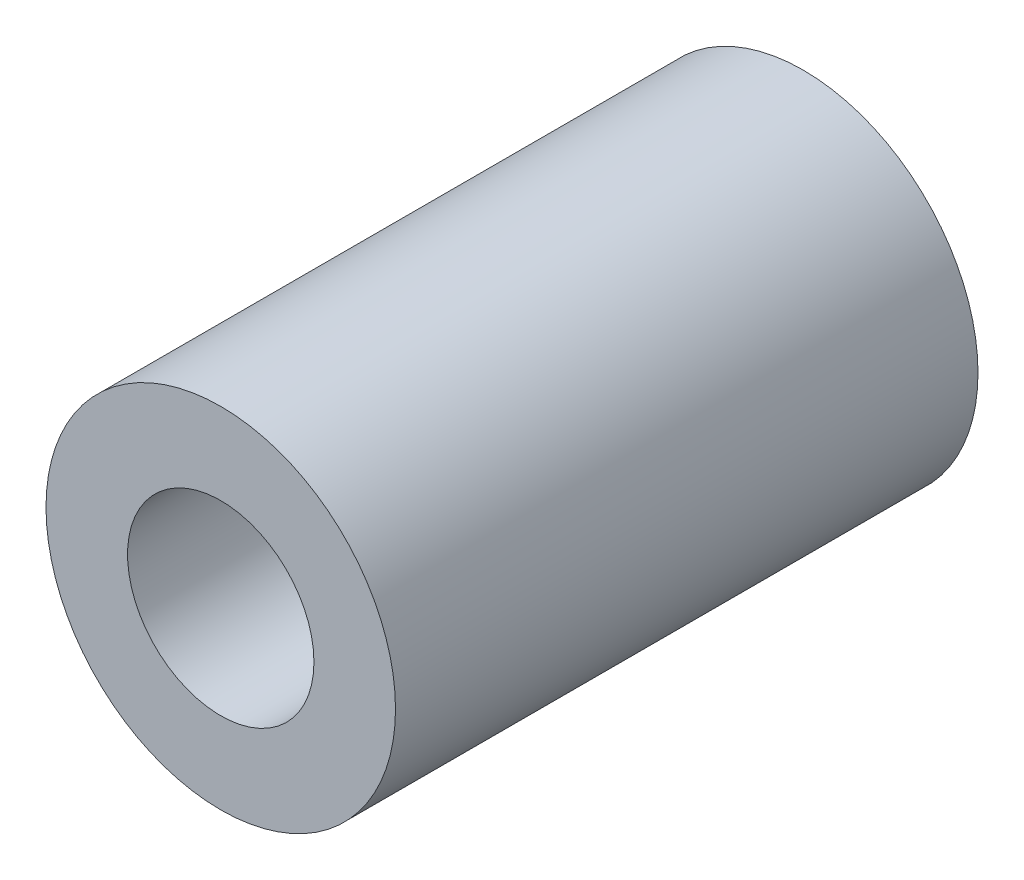
ISO-10303-21;
HEADER;
FILE_DESCRIPTION(('STEP AP214'),'2;1');
FILE_NAME('part.step','',(''),(''),'','','');
FILE_SCHEMA(('AUTOMOTIVE_DESIGN { 1 0 10303 214 1 1 1 1 }'));
ENDSEC;
DATA;
#1=APPLICATION_CONTEXT('core data for automotive mechanical design processes');
#2=APPLICATION_PROTOCOL_DEFINITION('international standard','automotive_design',2000,#1);
#3=PRODUCT_CONTEXT('',#1,'mechanical');
#4=PRODUCT('Part','Part','',(#3));
#5=PRODUCT_RELATED_PRODUCT_CATEGORY('part','',(#4));
#6=PRODUCT_DEFINITION_FORMATION('','',#4);
#7=PRODUCT_DEFINITION_CONTEXT('part definition',#1,'design');
#8=PRODUCT_DEFINITION('design','',#6,#7);
#9=PRODUCT_DEFINITION_SHAPE('','',#8);
#10=(LENGTH_UNIT() NAMED_UNIT(*) SI_UNIT(.MILLI.,.METRE.));
#11=(NAMED_UNIT(*) PLANE_ANGLE_UNIT() SI_UNIT($,.RADIAN.));
#12=(NAMED_UNIT(*) SI_UNIT($,.STERADIAN.) SOLID_ANGLE_UNIT());
#13=UNCERTAINTY_MEASURE_WITH_UNIT(LENGTH_MEASURE(1.E-05),#10,'distance_accuracy_value','');
#14=(GEOMETRIC_REPRESENTATION_CONTEXT(3) GLOBAL_UNCERTAINTY_ASSIGNED_CONTEXT((#13)) GLOBAL_UNIT_ASSIGNED_CONTEXT((#10,
#11,#12)) REPRESENTATION_CONTEXT('',''));
#15=CARTESIAN_POINT('',(0.,0.,0.));
#16=DIRECTION('',(0.,0.,1.));
#17=DIRECTION('',(1.,0.,0.));
#18=AXIS2_PLACEMENT_3D('',#15,#16,#17);
#19=CARTESIAN_POINT('',(0.,0.,10.));
#20=DIRECTION('',(0.,0.,1.));
#21=DIRECTION('',(1.,0.,0.));
#22=AXIS2_PLACEMENT_3D('',#19,#20,#21);
#23=PLANE('',#22);
#24=CARTESIAN_POINT('',(0.,0.,10.));
#25=DIRECTION('',(0.,0.,1.));
#26=DIRECTION('',(1.,0.,0.));
#27=AXIS2_PLACEMENT_3D('',#24,#25,#26);
#28=CIRCLE('',#27,3.);
#29=CARTESIAN_POINT('',(3.,0.,10.));
#30=VERTEX_POINT('',#29);
#31=EDGE_CURVE('E10',#30,#30,#28,.T.);
#32=ORIENTED_EDGE('',*,*,#31,.T.);
#33=EDGE_LOOP('',(#32));
#34=FACE_BOUND('',#33,.T.);
#35=CARTESIAN_POINT('',(0.,0.,10.));
#36=DIRECTION('',(0.,0.,1.));
#37=DIRECTION('',(1.,0.,0.));
#38=AXIS2_PLACEMENT_3D('',#35,#36,#37);
#39=CIRCLE('',#38,1.6);
#40=CARTESIAN_POINT('',(1.6,0.,10.));
#41=VERTEX_POINT('',#40);
#42=EDGE_CURVE('E42',#41,#41,#39,.T.);
#43=ORIENTED_EDGE('',*,*,#42,.F.);
#44=EDGE_LOOP('',(#43));
#45=FACE_BOUND('',#44,.T.);
#46=ADVANCED_FACE('F31',(#34,#45),#23,.T.);
#47=CARTESIAN_POINT('',(0.,0.,0.));
#48=DIRECTION('',(0.,0.,1.));
#49=DIRECTION('',(1.,0.,0.));
#50=AXIS2_PLACEMENT_3D('',#47,#48,#49);
#51=PLANE('',#50);
#52=CARTESIAN_POINT('',(0.,0.,0.));
#53=DIRECTION('',(0.,0.,1.));
#54=DIRECTION('',(1.,0.,0.));
#55=AXIS2_PLACEMENT_3D('',#52,#53,#54);
#56=CIRCLE('',#55,3.);
#57=CARTESIAN_POINT('',(3.,0.,0.));
#58=VERTEX_POINT('',#57);
#59=EDGE_CURVE('E35',#58,#58,#56,.T.);
#60=ORIENTED_EDGE('',*,*,#59,.F.);
#61=EDGE_LOOP('',(#60));
#62=FACE_BOUND('',#61,.T.);
#63=CARTESIAN_POINT('',(0.,0.,0.));
#64=DIRECTION('',(0.,0.,1.));
#65=DIRECTION('',(1.,0.,0.));
#66=AXIS2_PLACEMENT_3D('',#63,#64,#65);
#67=CIRCLE('',#66,1.6);
#68=CARTESIAN_POINT('',(1.6,0.,0.));
#69=VERTEX_POINT('',#68);
#70=EDGE_CURVE('E44',#69,#69,#67,.T.);
#71=ORIENTED_EDGE('',*,*,#70,.T.);
#72=EDGE_LOOP('',(#71));
#73=FACE_BOUND('',#72,.T.);
#74=ADVANCED_FACE('F54',(#62,#73),#51,.F.);
#75=CARTESIAN_POINT('',(0.,0.,10.));
#76=DIRECTION('',(0.,0.,-1.));
#77=DIRECTION('',(-1.,0.,0.));
#78=AXIS2_PLACEMENT_3D('',#75,#76,#77);
#79=CYLINDRICAL_SURFACE('',#78,3.);
#80=ORIENTED_EDGE('',*,*,#31,.F.);
#81=EDGE_LOOP('',(#80));
#82=FACE_BOUND('',#81,.T.);
#83=ORIENTED_EDGE('',*,*,#59,.T.);
#84=EDGE_LOOP('',(#83));
#85=FACE_BOUND('',#84,.T.);
#86=ADVANCED_FACE('F33',(#82,#85),#79,.T.);
#87=CARTESIAN_POINT('',(0.,0.,10.));
#88=DIRECTION('',(0.,0.,-1.));
#89=DIRECTION('',(-1.,0.,0.));
#90=AXIS2_PLACEMENT_3D('',#87,#88,#89);
#91=CYLINDRICAL_SURFACE('',#90,1.6);
#92=ORIENTED_EDGE('',*,*,#42,.T.);
#93=EDGE_LOOP('',(#92));
#94=FACE_BOUND('',#93,.T.);
#95=ORIENTED_EDGE('',*,*,#70,.F.);
#96=EDGE_LOOP('',(#95));
#97=FACE_BOUND('',#96,.T.);
#98=ADVANCED_FACE('F50',(#94,#97),#91,.F.);
#99=CLOSED_SHELL('',(#46,#74,#86,#98));
#100=MANIFOLD_SOLID_BREP('B2',#99);
#101=ADVANCED_BREP_SHAPE_REPRESENTATION('',(#18,#100),#14);
#102=SHAPE_DEFINITION_REPRESENTATION(#9,#101);
ENDSEC;
END-ISO-10303-21;
